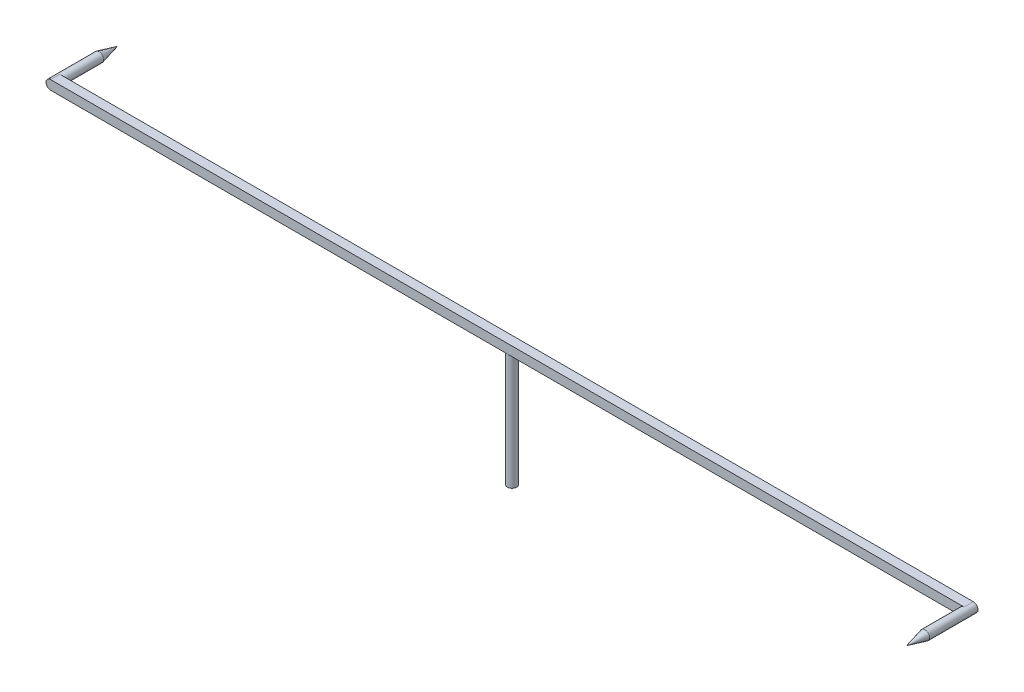
ISO-10303-21;
HEADER;
FILE_DESCRIPTION(('STEP AP214'),'2;1');
FILE_NAME('part.step','',(''),(''),'','','');
FILE_SCHEMA(('AUTOMOTIVE_DESIGN { 1 0 10303 214 1 1 1 1 }'));
ENDSEC;
DATA;
#1=APPLICATION_CONTEXT('core data for automotive mechanical design processes');
#2=APPLICATION_PROTOCOL_DEFINITION('international standard','automotive_design',2000,#1);
#3=PRODUCT_CONTEXT('',#1,'mechanical');
#4=PRODUCT('Part','Part','',(#3));
#5=PRODUCT_RELATED_PRODUCT_CATEGORY('part','',(#4));
#6=PRODUCT_DEFINITION_FORMATION('','',#4);
#7=PRODUCT_DEFINITION_CONTEXT('part definition',#1,'design');
#8=PRODUCT_DEFINITION('design','',#6,#7);
#9=PRODUCT_DEFINITION_SHAPE('','',#8);
#10=(LENGTH_UNIT() NAMED_UNIT(*) SI_UNIT(.MILLI.,.METRE.));
#11=(NAMED_UNIT(*) PLANE_ANGLE_UNIT() SI_UNIT($,.RADIAN.));
#12=(NAMED_UNIT(*) SI_UNIT($,.STERADIAN.) SOLID_ANGLE_UNIT());
#13=UNCERTAINTY_MEASURE_WITH_UNIT(LENGTH_MEASURE(1.E-05),#10,'distance_accuracy_value','');
#14=(GEOMETRIC_REPRESENTATION_CONTEXT(3) GLOBAL_UNCERTAINTY_ASSIGNED_CONTEXT((#13)) GLOBAL_UNIT_ASSIGNED_CONTEXT((#10,
#11,#12)) REPRESENTATION_CONTEXT('',''));
#15=CARTESIAN_POINT('',(0.,0.,0.));
#16=DIRECTION('',(0.,0.,1.));
#17=DIRECTION('',(1.,0.,0.));
#18=AXIS2_PLACEMENT_3D('',#15,#16,#17);
#19=CARTESIAN_POINT('',(0.,10.,0.));
#20=DIRECTION('',(0.,-1.,0.));
#21=DIRECTION('',(0.,0.,-1.));
#22=AXIS2_PLACEMENT_3D('',#19,#20,#21);
#23=CYLINDRICAL_SURFACE('',#22,0.4);
#24=CARTESIAN_POINT('',(0.,10.,0.));
#25=DIRECTION('',(0.,1.,0.));
#26=DIRECTION('',(0.,0.,1.));
#27=AXIS2_PLACEMENT_3D('',#24,#25,#26);
#28=CIRCLE('',#27,0.4);
#29=CARTESIAN_POINT('',(0.,10.,0.4));
#30=VERTEX_POINT('',#29);
#31=CARTESIAN_POINT('',(0.,10.,-0.4));
#32=VERTEX_POINT('',#31);
#33=EDGE_CURVE('E164',#30,#32,#28,.T.);
#34=ORIENTED_EDGE('',*,*,#33,.F.);
#35=EDGE_CURVE('E168',#32,#30,#28,.T.);
#36=ORIENTED_EDGE('',*,*,#35,.F.);
#37=EDGE_LOOP('',(#34,#36));
#38=FACE_BOUND('',#37,.T.);
#39=CARTESIAN_POINT('',(0.,0.,0.));
#40=DIRECTION('',(0.,1.,0.));
#41=DIRECTION('',(0.,0.,1.));
#42=AXIS2_PLACEMENT_3D('',#39,#40,#41);
#43=CIRCLE('',#42,0.4);
#44=CARTESIAN_POINT('',(0.,0.,0.4));
#45=VERTEX_POINT('',#44);
#46=EDGE_CURVE('E158',#45,#45,#43,.T.);
#47=ORIENTED_EDGE('',*,*,#46,.T.);
#48=EDGE_LOOP('',(#47));
#49=FACE_BOUND('',#48,.T.);
#50=ADVANCED_FACE('F37',(#38,#49),#23,.T.);
#51=CARTESIAN_POINT('',(0.,0.,0.));
#52=DIRECTION('',(0.,1.,0.));
#53=DIRECTION('',(0.,0.,1.));
#54=AXIS2_PLACEMENT_3D('',#51,#52,#53);
#55=PLANE('',#54);
#56=ORIENTED_EDGE('',*,*,#46,.F.);
#57=EDGE_LOOP('',(#56));
#58=FACE_BOUND('',#57,.T.);
#59=ADVANCED_FACE('F114',(#58),#55,.F.);
#60=CARTESIAN_POINT('',(0.,10.,0.));
#61=DIRECTION('',(0.,1.,0.));
#62=DIRECTION('',(0.,0.,1.));
#63=AXIS2_PLACEMENT_3D('',#60,#61,#62);
#64=PLANE('',#63);
#65=DIRECTION('',(-1.,0.,0.));
#66=VECTOR('',#65,1.);
#67=CARTESIAN_POINT('',(-40.,10.,-0.4));
#68=LINE('',#67,#66);
#69=CARTESIAN_POINT('',(39.6,10.,-0.4));
#70=VERTEX_POINT('',#69);
#71=EDGE_CURVE('E156',#70,#32,#68,.T.);
#72=ORIENTED_EDGE('',*,*,#71,.F.);
#73=DIRECTION('',(0.,0.,-1.));
#74=VECTOR('',#73,1.);
#75=CARTESIAN_POINT('',(39.6,10.,0.));
#76=LINE('',#75,#74);
#77=CARTESIAN_POINT('',(39.6,10.,0.4));
#78=VERTEX_POINT('',#77);
#79=EDGE_CURVE('E11',#70,#78,#76,.F.);
#80=ORIENTED_EDGE('',*,*,#79,.T.);
#81=DIRECTION('',(1.,0.,0.));
#82=VECTOR('',#81,1.);
#83=CARTESIAN_POINT('',(-40.,10.,0.4));
#84=LINE('',#83,#82);
#85=EDGE_CURVE('E162',#30,#78,#84,.T.);
#86=ORIENTED_EDGE('',*,*,#85,.F.);
#87=ORIENTED_EDGE('',*,*,#33,.T.);
#88=EDGE_LOOP('',(#72,#80,#86,#87));
#89=FACE_BOUND('',#88,.T.);
#90=ADVANCED_FACE('F120',(#89),#64,.F.);
#91=CARTESIAN_POINT('',(-39.6,10.,0.4));
#92=VERTEX_POINT('',#91);
#93=EDGE_CURVE('E159',#92,#30,#84,.T.);
#94=ORIENTED_EDGE('',*,*,#93,.F.);
#95=DIRECTION('',(0.,0.,1.));
#96=VECTOR('',#95,1.);
#97=CARTESIAN_POINT('',(-39.6,10.,0.));
#98=LINE('',#97,#96);
#99=CARTESIAN_POINT('',(-39.6,10.,-0.4));
#100=VERTEX_POINT('',#99);
#101=EDGE_CURVE('E174',#92,#100,#98,.F.);
#102=ORIENTED_EDGE('',*,*,#101,.T.);
#103=EDGE_CURVE('E161',#32,#100,#68,.T.);
#104=ORIENTED_EDGE('',*,*,#103,.F.);
#105=ORIENTED_EDGE('',*,*,#35,.T.);
#106=EDGE_LOOP('',(#94,#102,#104,#105));
#107=FACE_BOUND('',#106,.T.);
#108=ADVANCED_FACE('F197',(#107),#64,.F.);
#109=CARTESIAN_POINT('',(-40.,10.8,0.4));
#110=DIRECTION('',(0.,0.,-1.));
#111=DIRECTION('',(-1.,0.,0.));
#112=AXIS2_PLACEMENT_3D('',#109,#110,#111);
#113=PLANE('',#112);
#114=CARTESIAN_POINT('',(39.6,10.4,0.4));
#115=DIRECTION('',(0.,0.,1.));
#116=DIRECTION('',(1.,0.,0.));
#117=AXIS2_PLACEMENT_3D('',#114,#115,#116);
#118=CIRCLE('',#117,0.399999999999998);
#119=CARTESIAN_POINT('',(39.6,10.8,0.4));
#120=VERTEX_POINT('',#119);
#121=EDGE_CURVE('E143',#120,#78,#118,.T.);
#122=ORIENTED_EDGE('',*,*,#121,.F.);
#123=DIRECTION('',(1.,0.,0.));
#124=VECTOR('',#123,1.);
#125=CARTESIAN_POINT('',(-40.,10.8,0.4));
#126=LINE('',#125,#124);
#127=CARTESIAN_POINT('',(-39.6,10.8,0.4));
#128=VERTEX_POINT('',#127);
#129=EDGE_CURVE('E152',#128,#120,#126,.T.);
#130=ORIENTED_EDGE('',*,*,#129,.F.);
#131=CARTESIAN_POINT('',(-39.6,10.4,0.4));
#132=DIRECTION('',(0.,0.,-1.));
#133=DIRECTION('',(-1.,0.,0.));
#134=AXIS2_PLACEMENT_3D('',#131,#132,#133);
#135=CIRCLE('',#134,0.4);
#136=CARTESIAN_POINT('',(-40.,10.4,0.4));
#137=VERTEX_POINT('',#136);
#138=EDGE_CURVE('E167',#128,#137,#135,.F.);
#139=ORIENTED_EDGE('',*,*,#138,.T.);
#140=CARTESIAN_POINT('',(-39.6,10.4,0.4));
#141=DIRECTION('',(0.,0.,-1.));
#142=DIRECTION('',(-1.,0.,0.));
#143=AXIS2_PLACEMENT_3D('',#140,#141,#142);
#144=CIRCLE('',#143,0.4);
#145=EDGE_CURVE('E172',#137,#92,#144,.F.);
#146=ORIENTED_EDGE('',*,*,#145,.T.);
#147=ORIENTED_EDGE('',*,*,#93,.T.);
#148=ORIENTED_EDGE('',*,*,#85,.T.);
#149=EDGE_LOOP('',(#122,#130,#139,#146,#147,#148));
#150=FACE_BOUND('',#149,.T.);
#151=ADVANCED_FACE('F200',(#150),#113,.F.);
#152=CARTESIAN_POINT('',(-40.,10.8,-0.4));
#153=DIRECTION('',(0.,0.,1.));
#154=DIRECTION('',(1.,0.,0.));
#155=AXIS2_PLACEMENT_3D('',#152,#153,#154);
#156=PLANE('',#155);
#157=CARTESIAN_POINT('',(-39.6,10.4,-0.4));
#158=DIRECTION('',(0.,0.,-1.));
#159=DIRECTION('',(-1.,0.,0.));
#160=AXIS2_PLACEMENT_3D('',#157,#158,#159);
#161=CIRCLE('',#160,0.399999999999998);
#162=CARTESIAN_POINT('',(-39.6,10.8,-0.4));
#163=VERTEX_POINT('',#162);
#164=EDGE_CURVE('E60',#163,#100,#161,.T.);
#165=ORIENTED_EDGE('',*,*,#164,.F.);
#166=DIRECTION('',(-1.,0.,0.));
#167=VECTOR('',#166,1.);
#168=CARTESIAN_POINT('',(-40.,10.8,-0.4));
#169=LINE('',#168,#167);
#170=CARTESIAN_POINT('',(39.6,10.8,-0.4));
#171=VERTEX_POINT('',#170);
#172=EDGE_CURVE('E155',#171,#163,#169,.T.);
#173=ORIENTED_EDGE('',*,*,#172,.F.);
#174=CARTESIAN_POINT('',(39.6,10.4,-0.4));
#175=DIRECTION('',(0.,0.,1.));
#176=DIRECTION('',(1.,0.,0.));
#177=AXIS2_PLACEMENT_3D('',#174,#175,#176);
#178=CIRCLE('',#177,0.4);
#179=CARTESIAN_POINT('',(40.,10.4,-0.4));
#180=VERTEX_POINT('',#179);
#181=EDGE_CURVE('E54',#171,#180,#178,.F.);
#182=ORIENTED_EDGE('',*,*,#181,.T.);
#183=CARTESIAN_POINT('',(39.6,10.4,-0.4));
#184=DIRECTION('',(0.,0.,1.));
#185=DIRECTION('',(1.,0.,0.));
#186=AXIS2_PLACEMENT_3D('',#183,#184,#185);
#187=CIRCLE('',#186,0.4);
#188=EDGE_CURVE('E177',#180,#70,#187,.F.);
#189=ORIENTED_EDGE('',*,*,#188,.T.);
#190=ORIENTED_EDGE('',*,*,#71,.T.);
#191=ORIENTED_EDGE('',*,*,#103,.T.);
#192=EDGE_LOOP('',(#165,#173,#182,#189,#190,#191));
#193=FACE_BOUND('',#192,.T.);
#194=ADVANCED_FACE('F135',(#193),#156,.F.);
#195=CARTESIAN_POINT('',(0.,10.8,0.));
#196=DIRECTION('',(0.,1.,0.));
#197=DIRECTION('',(0.,0.,1.));
#198=AXIS2_PLACEMENT_3D('',#195,#196,#197);
#199=PLANE('',#198);
#200=ORIENTED_EDGE('',*,*,#172,.T.);
#201=DIRECTION('',(0.,0.,1.));
#202=VECTOR('',#201,1.);
#203=CARTESIAN_POINT('',(-39.6,10.8,0.4));
#204=LINE('',#203,#202);
#205=EDGE_CURVE('E46',#163,#128,#204,.T.);
#206=ORIENTED_EDGE('',*,*,#205,.T.);
#207=ORIENTED_EDGE('',*,*,#129,.T.);
#208=DIRECTION('',(0.,0.,-1.));
#209=VECTOR('',#208,1.);
#210=CARTESIAN_POINT('',(39.6,10.8,-0.4));
#211=LINE('',#210,#209);
#212=EDGE_CURVE('E179',#120,#171,#211,.T.);
#213=ORIENTED_EDGE('',*,*,#212,.T.);
#214=EDGE_LOOP('',(#200,#206,#207,#213));
#215=FACE_BOUND('',#214,.T.);
#216=ADVANCED_FACE('F128',(#215),#199,.T.);
#217=CARTESIAN_POINT('',(-39.6,10.4,0.));
#218=DIRECTION('',(0.,0.,-1.));
#219=DIRECTION('',(-1.,0.,0.));
#220=AXIS2_PLACEMENT_3D('',#217,#218,#219);
#221=CYLINDRICAL_SURFACE('',#220,0.4);
#222=ORIENTED_EDGE('',*,*,#205,.F.);
#223=ORIENTED_EDGE('',*,*,#164,.T.);
#224=ORIENTED_EDGE('',*,*,#101,.F.);
#225=ORIENTED_EDGE('',*,*,#145,.F.);
#226=DIRECTION('',(0.,0.,1.));
#227=VECTOR('',#226,1.);
#228=CARTESIAN_POINT('',(-40.,10.4,-0.4));
#229=LINE('',#228,#227);
#230=CARTESIAN_POINT('',(-40.,10.4,-0.4));
#231=VERTEX_POINT('',#230);
#232=EDGE_CURVE('E181',#137,#231,#229,.F.);
#233=ORIENTED_EDGE('',*,*,#232,.T.);
#234=ORIENTED_EDGE('',*,*,#232,.F.);
#235=ORIENTED_EDGE('',*,*,#138,.F.);
#236=EDGE_LOOP('',(#222,#223,#224,#225,#233,#234,#235));
#237=FACE_BOUND('',#236,.T.);
#238=CARTESIAN_POINT('',(-39.6,10.4,-3.8));
#239=DIRECTION('',(0.,0.,-1.));
#240=DIRECTION('',(-1.,0.,0.));
#241=AXIS2_PLACEMENT_3D('',#238,#239,#240);
#242=CIRCLE('',#241,0.399999999999998);
#243=CARTESIAN_POINT('',(-40.,10.4,-3.8));
#244=VERTEX_POINT('',#243);
#245=EDGE_CURVE('E142',#244,#244,#242,.T.);
#246=ORIENTED_EDGE('',*,*,#245,.F.);
#247=EDGE_LOOP('',(#246));
#248=FACE_BOUND('',#247,.T.);
#249=ADVANCED_FACE('F126',(#237,#248),#221,.T.);
#250=CARTESIAN_POINT('',(39.6,10.4,0.));
#251=DIRECTION('',(0.,0.,1.));
#252=DIRECTION('',(1.,0.,0.));
#253=AXIS2_PLACEMENT_3D('',#250,#251,#252);
#254=CYLINDRICAL_SURFACE('',#253,0.4);
#255=ORIENTED_EDGE('',*,*,#212,.F.);
#256=ORIENTED_EDGE('',*,*,#121,.T.);
#257=ORIENTED_EDGE('',*,*,#79,.F.);
#258=ORIENTED_EDGE('',*,*,#188,.F.);
#259=DIRECTION('',(0.,0.,-1.));
#260=VECTOR('',#259,1.);
#261=CARTESIAN_POINT('',(40.,10.4,0.4));
#262=LINE('',#261,#260);
#263=CARTESIAN_POINT('',(40.,10.4,0.4));
#264=VERTEX_POINT('',#263);
#265=EDGE_CURVE('E41',#180,#264,#262,.F.);
#266=ORIENTED_EDGE('',*,*,#265,.T.);
#267=ORIENTED_EDGE('',*,*,#265,.F.);
#268=ORIENTED_EDGE('',*,*,#181,.F.);
#269=EDGE_LOOP('',(#255,#256,#257,#258,#266,#267,#268));
#270=FACE_BOUND('',#269,.T.);
#271=CARTESIAN_POINT('',(39.6,10.4,3.8));
#272=DIRECTION('',(0.,0.,1.));
#273=DIRECTION('',(1.,0.,0.));
#274=AXIS2_PLACEMENT_3D('',#271,#272,#273);
#275=CIRCLE('',#274,0.399999999999998);
#276=CARTESIAN_POINT('',(40.,10.4,3.8));
#277=VERTEX_POINT('',#276);
#278=EDGE_CURVE('E146',#277,#277,#275,.T.);
#279=ORIENTED_EDGE('',*,*,#278,.F.);
#280=EDGE_LOOP('',(#279));
#281=FACE_BOUND('',#280,.T.);
#282=ADVANCED_FACE('F39',(#270,#281),#254,.T.);
#283=CARTESIAN_POINT('',(39.6,10.4,5.4));
#284=DIRECTION('',(0.,0.,-1.));
#285=DIRECTION('',(-1.,0.,0.));
#286=AXIS2_PLACEMENT_3D('',#283,#284,#285);
#287=CONICAL_SURFACE('',#286,0.,0.244978663126863);
#288=ORIENTED_EDGE('',*,*,#278,.T.);
#289=EDGE_LOOP('',(#288));
#290=FACE_BOUND('',#289,.T.);
#291=CARTESIAN_POINT('',(39.6,10.4,5.4));
#292=VERTEX_POINT('',#291);
#293=VERTEX_LOOP('',#292);
#294=FACE_BOUND('',#293,.T.);
#295=ADVANCED_FACE('F104',(#290,#294),#287,.T.);
#296=CARTESIAN_POINT('',(-39.6,10.4,-5.4));
#297=DIRECTION('',(0.,0.,1.));
#298=DIRECTION('',(1.,0.,0.));
#299=AXIS2_PLACEMENT_3D('',#296,#297,#298);
#300=CONICAL_SURFACE('',#299,0.,0.244978663126863);
#301=ORIENTED_EDGE('',*,*,#245,.T.);
#302=EDGE_LOOP('',(#301));
#303=FACE_BOUND('',#302,.T.);
#304=CARTESIAN_POINT('',(-39.6,10.4,-5.4));
#305=VERTEX_POINT('',#304);
#306=VERTEX_LOOP('',#305);
#307=FACE_BOUND('',#306,.T.);
#308=ADVANCED_FACE('F102',(#303,#307),#300,.T.);
#309=CLOSED_SHELL('',(#50,#59,#90,#108,#151,#194,#216,#249,#282,#295,#308));
#310=MANIFOLD_SOLID_BREP('B2',#309);
#311=ADVANCED_BREP_SHAPE_REPRESENTATION('',(#18,#310),#14);
#312=SHAPE_DEFINITION_REPRESENTATION(#9,#311);
ENDSEC;
END-ISO-10303-21;
